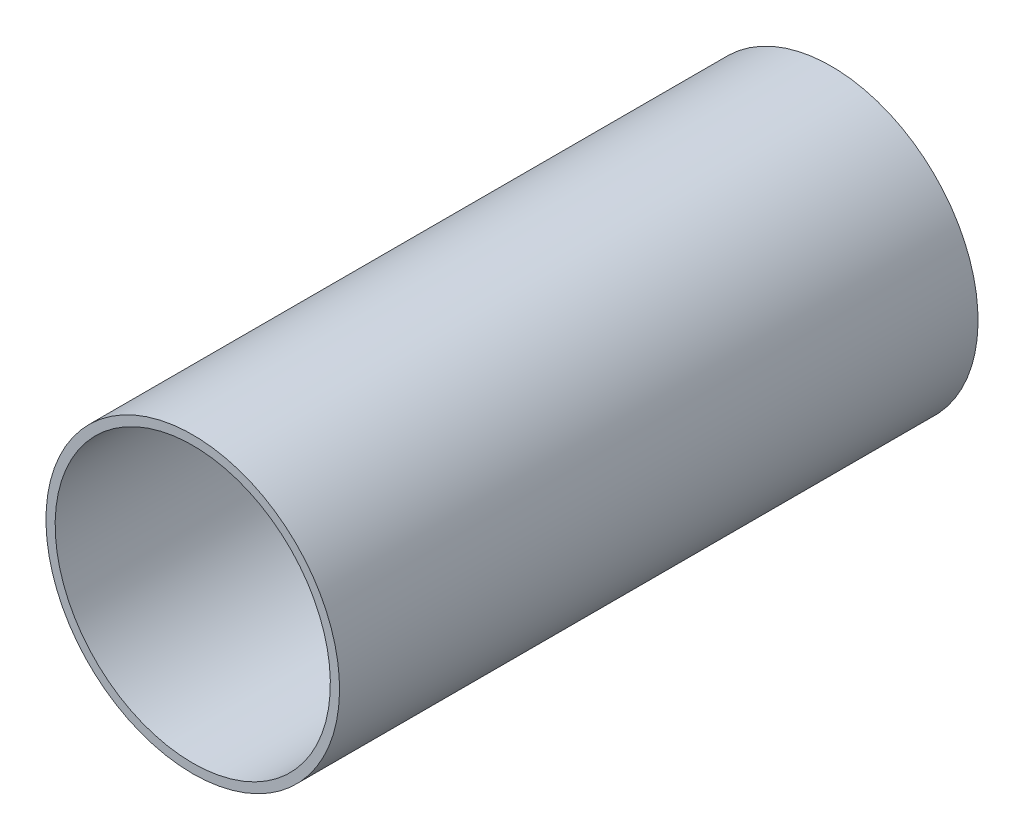
ISO-10303-21;
HEADER;
FILE_DESCRIPTION(('STEP AP214'),'2;1');
FILE_NAME('part.step','',(''),(''),'','','');
FILE_SCHEMA(('AUTOMOTIVE_DESIGN { 1 0 10303 214 1 1 1 1 }'));
ENDSEC;
DATA;
#1=APPLICATION_CONTEXT('core data for automotive mechanical design processes');
#2=APPLICATION_PROTOCOL_DEFINITION('international standard','automotive_design',2000,#1);
#3=PRODUCT_CONTEXT('',#1,'mechanical');
#4=PRODUCT('Part','Part','',(#3));
#5=PRODUCT_RELATED_PRODUCT_CATEGORY('part','',(#4));
#6=PRODUCT_DEFINITION_FORMATION('','',#4);
#7=PRODUCT_DEFINITION_CONTEXT('part definition',#1,'design');
#8=PRODUCT_DEFINITION('design','',#6,#7);
#9=PRODUCT_DEFINITION_SHAPE('','',#8);
#10=(LENGTH_UNIT() NAMED_UNIT(*) SI_UNIT(.MILLI.,.METRE.));
#11=(NAMED_UNIT(*) PLANE_ANGLE_UNIT() SI_UNIT($,.RADIAN.));
#12=(NAMED_UNIT(*) SI_UNIT($,.STERADIAN.) SOLID_ANGLE_UNIT());
#13=UNCERTAINTY_MEASURE_WITH_UNIT(LENGTH_MEASURE(1.E-05),#10,'distance_accuracy_value','');
#14=(GEOMETRIC_REPRESENTATION_CONTEXT(3) GLOBAL_UNCERTAINTY_ASSIGNED_CONTEXT((#13)) GLOBAL_UNIT_ASSIGNED_CONTEXT((#10,
#11,#12)) REPRESENTATION_CONTEXT('',''));
#15=CARTESIAN_POINT('',(0.,0.,0.));
#16=DIRECTION('',(0.,0.,1.));
#17=DIRECTION('',(1.,0.,0.));
#18=AXIS2_PLACEMENT_3D('',#15,#16,#17);
#19=CARTESIAN_POINT('',(129.54,-103.632,-0.045));
#20=DIRECTION('',(0.,0.,-1.));
#21=DIRECTION('',(0.,-1.,0.));
#22=AXIS2_PLACEMENT_3D('',#19,#20,#21);
#23=CYLINDRICAL_SURFACE('',#22,0.375);
#24=CARTESIAN_POINT('',(129.54,-103.632,-0.035));
#25=DIRECTION('',(0.,0.,-1.));
#26=DIRECTION('',(0.,-1.,0.));
#27=AXIS2_PLACEMENT_3D('',#24,#25,#26);
#28=CIRCLE('',#27,0.375);
#29=CARTESIAN_POINT('',(129.54,-104.007,-0.035));
#30=VERTEX_POINT('',#29);
#31=EDGE_CURVE('E64',#30,#30,#28,.T.);
#32=ORIENTED_EDGE('',*,*,#31,.T.);
#33=DIRECTION('',(0.,0.,1.));
#34=VECTOR('',#33,1.);
#35=CARTESIAN_POINT('',(129.54,-104.007,-0.045));
#36=LINE('',#35,#34);
#37=CARTESIAN_POINT('',(129.54,-104.007,1.705));
#38=VERTEX_POINT('',#37);
#39=EDGE_CURVE('E11',#30,#38,#36,.T.);
#40=ORIENTED_EDGE('',*,*,#39,.T.);
#41=CARTESIAN_POINT('',(129.54,-103.632,1.705));
#42=DIRECTION('',(0.,0.,-1.));
#43=DIRECTION('',(0.,-1.,0.));
#44=AXIS2_PLACEMENT_3D('',#41,#42,#43);
#45=CIRCLE('',#44,0.375);
#46=EDGE_CURVE('E25',#38,#38,#45,.T.);
#47=ORIENTED_EDGE('',*,*,#46,.F.);
#48=ORIENTED_EDGE('',*,*,#39,.F.);
#49=EDGE_LOOP('',(#32,#40,#47,#48));
#50=FACE_BOUND('',#49,.T.);
#51=ADVANCED_FACE('F17',(#50),#23,.F.);
#52=CARTESIAN_POINT('',(129.54,-104.032,1.705));
#53=DIRECTION('',(0.,0.,1.));
#54=DIRECTION('',(1.,0.,0.));
#55=AXIS2_PLACEMENT_3D('',#52,#53,#54);
#56=PLANE('',#55);
#57=ORIENTED_EDGE('',*,*,#46,.T.);
#58=EDGE_LOOP('',(#57));
#59=FACE_BOUND('',#58,.T.);
#60=CARTESIAN_POINT('',(129.54,-103.632,1.705));
#61=DIRECTION('',(0.,0.,1.));
#62=DIRECTION('',(0.,-1.,0.));
#63=AXIS2_PLACEMENT_3D('',#60,#61,#62);
#64=CIRCLE('',#63,0.4);
#65=CARTESIAN_POINT('',(129.54,-104.032,1.705));
#66=VERTEX_POINT('',#65);
#67=EDGE_CURVE('E56',#66,#66,#64,.T.);
#68=ORIENTED_EDGE('',*,*,#67,.T.);
#69=EDGE_LOOP('',(#68));
#70=FACE_BOUND('',#69,.T.);
#71=ADVANCED_FACE('F77',(#59,#70),#56,.T.);
#72=CARTESIAN_POINT('',(129.54,-104.032,-0.035));
#73=DIRECTION('',(0.,0.,1.));
#74=DIRECTION('',(1.,0.,0.));
#75=AXIS2_PLACEMENT_3D('',#72,#73,#74);
#76=PLANE('',#75);
#77=ORIENTED_EDGE('',*,*,#31,.F.);
#78=EDGE_LOOP('',(#77));
#79=FACE_BOUND('',#78,.T.);
#80=CARTESIAN_POINT('',(129.54,-103.632,-0.035));
#81=DIRECTION('',(0.,0.,1.));
#82=DIRECTION('',(0.,-1.,0.));
#83=AXIS2_PLACEMENT_3D('',#80,#81,#82);
#84=CIRCLE('',#83,0.4);
#85=CARTESIAN_POINT('',(129.54,-104.032,-0.035));
#86=VERTEX_POINT('',#85);
#87=EDGE_CURVE('E55',#86,#86,#84,.T.);
#88=ORIENTED_EDGE('',*,*,#87,.F.);
#89=EDGE_LOOP('',(#88));
#90=FACE_BOUND('',#89,.T.);
#91=ADVANCED_FACE('F74',(#79,#90),#76,.F.);
#92=CARTESIAN_POINT('',(129.54,-103.632,-0.035));
#93=DIRECTION('',(0.,0.,-1.));
#94=DIRECTION('',(0.,-1.,0.));
#95=AXIS2_PLACEMENT_3D('',#92,#93,#94);
#96=CYLINDRICAL_SURFACE('',#95,0.4);
#97=ORIENTED_EDGE('',*,*,#87,.T.);
#98=DIRECTION('',(0.,0.,1.));
#99=VECTOR('',#98,1.);
#100=CARTESIAN_POINT('',(129.54,-104.032,-0.035));
#101=LINE('',#100,#99);
#102=EDGE_CURVE('E52',#86,#66,#101,.T.);
#103=ORIENTED_EDGE('',*,*,#102,.T.);
#104=ORIENTED_EDGE('',*,*,#67,.F.);
#105=ORIENTED_EDGE('',*,*,#102,.F.);
#106=EDGE_LOOP('',(#97,#103,#104,#105));
#107=FACE_BOUND('',#106,.T.);
#108=ADVANCED_FACE('F53',(#107),#96,.T.);
#109=CLOSED_SHELL('',(#51,#71,#91,#108));
#110=MANIFOLD_SOLID_BREP('B1',#109);
#111=ADVANCED_BREP_SHAPE_REPRESENTATION('',(#18,#110),#14);
#112=SHAPE_DEFINITION_REPRESENTATION(#9,#111);
ENDSEC;
END-ISO-10303-21;
